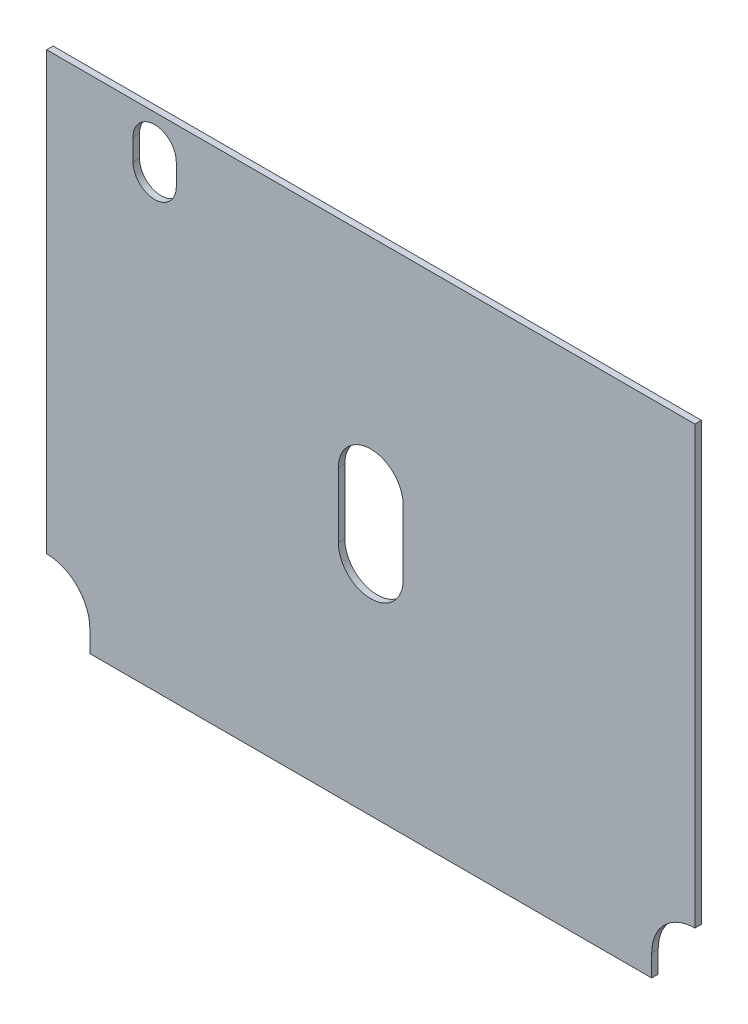
ISO-10303-21;
HEADER;
FILE_DESCRIPTION(('STEP AP214'),'2;1');
FILE_NAME('part.step','',(''),(''),'','','');
FILE_SCHEMA(('AUTOMOTIVE_DESIGN { 1 0 10303 214 1 1 1 1 }'));
ENDSEC;
DATA;
#1=APPLICATION_CONTEXT('core data for automotive mechanical design processes');
#2=APPLICATION_PROTOCOL_DEFINITION('international standard','automotive_design',2000,#1);
#3=PRODUCT_CONTEXT('',#1,'mechanical');
#4=PRODUCT('Part','Part','',(#3));
#5=PRODUCT_RELATED_PRODUCT_CATEGORY('part','',(#4));
#6=PRODUCT_DEFINITION_FORMATION('','',#4);
#7=PRODUCT_DEFINITION_CONTEXT('part definition',#1,'design');
#8=PRODUCT_DEFINITION('design','',#6,#7);
#9=PRODUCT_DEFINITION_SHAPE('','',#8);
#10=(LENGTH_UNIT() NAMED_UNIT(*) SI_UNIT(.MILLI.,.METRE.));
#11=(NAMED_UNIT(*) PLANE_ANGLE_UNIT() SI_UNIT($,.RADIAN.));
#12=(NAMED_UNIT(*) SI_UNIT($,.STERADIAN.) SOLID_ANGLE_UNIT());
#13=UNCERTAINTY_MEASURE_WITH_UNIT(LENGTH_MEASURE(1.E-05),#10,'distance_accuracy_value','');
#14=(GEOMETRIC_REPRESENTATION_CONTEXT(3) GLOBAL_UNCERTAINTY_ASSIGNED_CONTEXT((#13)) GLOBAL_UNIT_ASSIGNED_CONTEXT((#10,
#11,#12)) REPRESENTATION_CONTEXT('',''));
#15=CARTESIAN_POINT('',(0.,0.,0.));
#16=DIRECTION('',(0.,0.,1.));
#17=DIRECTION('',(1.,0.,0.));
#18=AXIS2_PLACEMENT_3D('',#15,#16,#17);
#19=CARTESIAN_POINT('',(-150.,9.99999999999999,3.));
#20=DIRECTION('',(0.,0.,-1.));
#21=DIRECTION('',(-1.,0.,0.));
#22=AXIS2_PLACEMENT_3D('',#19,#20,#21);
#23=PLANE('',#22);
#24=CARTESIAN_POINT('',(0.,102.,3.));
#25=DIRECTION('',(0.,0.,1.));
#26=DIRECTION('',(1.,0.,0.));
#27=AXIS2_PLACEMENT_3D('',#24,#25,#26);
#28=CIRCLE('',#27,15.);
#29=CARTESIAN_POINT('',(-15.,102.,3.));
#30=VERTEX_POINT('',#29);
#31=CARTESIAN_POINT('',(15.,102.,3.));
#32=VERTEX_POINT('',#31);
#33=EDGE_CURVE('E180',#30,#32,#28,.T.);
#34=ORIENTED_EDGE('',*,*,#33,.F.);
#35=DIRECTION('',(0.,-1.,0.));
#36=VECTOR('',#35,1.);
#37=CARTESIAN_POINT('',(-15.,102.,3.));
#38=LINE('',#37,#36);
#39=CARTESIAN_POINT('',(-15.,132.,3.));
#40=VERTEX_POINT('',#39);
#41=EDGE_CURVE('E188',#40,#30,#38,.T.);
#42=ORIENTED_EDGE('',*,*,#41,.F.);
#43=CARTESIAN_POINT('',(0.,132.,3.));
#44=DIRECTION('',(0.,0.,1.));
#45=DIRECTION('',(-1.,0.,0.));
#46=AXIS2_PLACEMENT_3D('',#43,#44,#45);
#47=CIRCLE('',#46,15.);
#48=CARTESIAN_POINT('',(15.,132.,3.));
#49=VERTEX_POINT('',#48);
#50=EDGE_CURVE('E185',#49,#40,#47,.T.);
#51=ORIENTED_EDGE('',*,*,#50,.F.);
#52=DIRECTION('',(0.,1.,0.));
#53=VECTOR('',#52,1.);
#54=CARTESIAN_POINT('',(15.,132.,3.));
#55=LINE('',#54,#53);
#56=EDGE_CURVE('E182',#32,#49,#55,.T.);
#57=ORIENTED_EDGE('',*,*,#56,.F.);
#58=EDGE_LOOP('',(#34,#42,#51,#57));
#59=FACE_BOUND('',#58,.T.);
#60=DIRECTION('',(0.,-1.,0.));
#61=VECTOR('',#60,1.);
#62=CARTESIAN_POINT('',(-150.,232.,3.));
#63=LINE('',#62,#61);
#64=CARTESIAN_POINT('',(-150.,232.,3.));
#65=VERTEX_POINT('',#64);
#66=CARTESIAN_POINT('',(-150.,30.,3.));
#67=VERTEX_POINT('',#66);
#68=EDGE_CURVE('E211',#65,#67,#63,.T.);
#69=ORIENTED_EDGE('',*,*,#68,.T.);
#70=CARTESIAN_POINT('',(-150.,9.99999999999999,3.));
#71=DIRECTION('',(0.,0.,-1.));
#72=DIRECTION('',(-1.,0.,0.));
#73=AXIS2_PLACEMENT_3D('',#70,#71,#72);
#74=CIRCLE('',#73,20.);
#75=CARTESIAN_POINT('',(-130.,9.99999999999999,3.));
#76=VERTEX_POINT('',#75);
#77=EDGE_CURVE('E214',#67,#76,#74,.T.);
#78=ORIENTED_EDGE('',*,*,#77,.T.);
#79=DIRECTION('',(0.,-1.,0.));
#80=VECTOR('',#79,1.);
#81=CARTESIAN_POINT('',(-130.,0.,3.));
#82=LINE('',#81,#80);
#83=CARTESIAN_POINT('',(-130.,0.,3.));
#84=VERTEX_POINT('',#83);
#85=EDGE_CURVE('E217',#76,#84,#82,.T.);
#86=ORIENTED_EDGE('',*,*,#85,.T.);
#87=DIRECTION('',(1.,0.,0.));
#88=VECTOR('',#87,1.);
#89=CARTESIAN_POINT('',(130.,0.,3.));
#90=LINE('',#89,#88);
#91=CARTESIAN_POINT('',(130.,0.,3.));
#92=VERTEX_POINT('',#91);
#93=EDGE_CURVE('E219',#84,#92,#90,.T.);
#94=ORIENTED_EDGE('',*,*,#93,.T.);
#95=DIRECTION('',(0.,1.,0.));
#96=VECTOR('',#95,1.);
#97=CARTESIAN_POINT('',(130.,0.,3.));
#98=LINE('',#97,#96);
#99=CARTESIAN_POINT('',(130.,9.99999999999999,3.));
#100=VERTEX_POINT('',#99);
#101=EDGE_CURVE('E221',#92,#100,#98,.T.);
#102=ORIENTED_EDGE('',*,*,#101,.T.);
#103=CARTESIAN_POINT('',(150.,9.99999999999998,3.));
#104=DIRECTION('',(0.,0.,-1.));
#105=DIRECTION('',(1.,0.,0.));
#106=AXIS2_PLACEMENT_3D('',#103,#104,#105);
#107=CIRCLE('',#106,20.);
#108=CARTESIAN_POINT('',(150.,30.,3.));
#109=VERTEX_POINT('',#108);
#110=EDGE_CURVE('E223',#100,#109,#107,.T.);
#111=ORIENTED_EDGE('',*,*,#110,.T.);
#112=DIRECTION('',(0.,1.,0.));
#113=VECTOR('',#112,1.);
#114=CARTESIAN_POINT('',(150.,232.,3.));
#115=LINE('',#114,#113);
#116=CARTESIAN_POINT('',(150.,232.,3.));
#117=VERTEX_POINT('',#116);
#118=EDGE_CURVE('E225',#109,#117,#115,.T.);
#119=ORIENTED_EDGE('',*,*,#118,.T.);
#120=DIRECTION('',(-1.,0.,0.));
#121=VECTOR('',#120,1.);
#122=CARTESIAN_POINT('',(150.,232.,3.));
#123=LINE('',#122,#121);
#124=EDGE_CURVE('E227',#117,#65,#123,.T.);
#125=ORIENTED_EDGE('',*,*,#124,.T.);
#126=EDGE_LOOP('',(#69,#78,#86,#94,#102,#111,#119,#125));
#127=FACE_BOUND('',#126,.T.);
#128=CARTESIAN_POINT('',(-100.,207.,3.));
#129=DIRECTION('',(0.,0.,1.));
#130=DIRECTION('',(1.,0.,0.));
#131=AXIS2_PLACEMENT_3D('',#128,#129,#130);
#132=CIRCLE('',#131,10.);
#133=CARTESIAN_POINT('',(-110.,207.,3.));
#134=VERTEX_POINT('',#133);
#135=CARTESIAN_POINT('',(-90.,207.,3.));
#136=VERTEX_POINT('',#135);
#137=EDGE_CURVE('E144',#134,#136,#132,.T.);
#138=ORIENTED_EDGE('',*,*,#137,.F.);
#139=DIRECTION('',(0.,-1.,0.));
#140=VECTOR('',#139,1.);
#141=CARTESIAN_POINT('',(-110.,207.,3.));
#142=LINE('',#141,#140);
#143=CARTESIAN_POINT('',(-110.,217.,3.));
#144=VERTEX_POINT('',#143);
#145=EDGE_CURVE('E166',#144,#134,#142,.T.);
#146=ORIENTED_EDGE('',*,*,#145,.F.);
#147=CARTESIAN_POINT('',(-100.,217.,3.));
#148=DIRECTION('',(0.,0.,1.));
#149=DIRECTION('',(-1.,0.,0.));
#150=AXIS2_PLACEMENT_3D('',#147,#148,#149);
#151=CIRCLE('',#150,10.);
#152=CARTESIAN_POINT('',(-90.,217.,3.));
#153=VERTEX_POINT('',#152);
#154=EDGE_CURVE('E164',#153,#144,#151,.T.);
#155=ORIENTED_EDGE('',*,*,#154,.F.);
#156=DIRECTION('',(0.,1.,0.));
#157=VECTOR('',#156,1.);
#158=CARTESIAN_POINT('',(-90.,217.,3.));
#159=LINE('',#158,#157);
#160=EDGE_CURVE('E152',#136,#153,#159,.T.);
#161=ORIENTED_EDGE('',*,*,#160,.F.);
#162=EDGE_LOOP('',(#138,#146,#155,#161));
#163=FACE_BOUND('',#162,.T.);
#164=ADVANCED_FACE('F31',(#59,#127,#163),#23,.F.);
#165=CARTESIAN_POINT('',(-150.,9.99999999999999,0.));
#166=DIRECTION('',(0.,0.,-1.));
#167=DIRECTION('',(-1.,0.,0.));
#168=AXIS2_PLACEMENT_3D('',#165,#166,#167);
#169=PLANE('',#168);
#170=DIRECTION('',(0.,-1.,0.));
#171=VECTOR('',#170,1.);
#172=CARTESIAN_POINT('',(-15.,102.,0.));
#173=LINE('',#172,#171);
#174=CARTESIAN_POINT('',(-15.,132.,0.));
#175=VERTEX_POINT('',#174);
#176=CARTESIAN_POINT('',(-15.,102.,0.));
#177=VERTEX_POINT('',#176);
#178=EDGE_CURVE('E183',#175,#177,#173,.T.);
#179=ORIENTED_EDGE('',*,*,#178,.T.);
#180=CARTESIAN_POINT('',(0.,102.,0.));
#181=DIRECTION('',(0.,0.,1.));
#182=DIRECTION('',(1.,0.,0.));
#183=AXIS2_PLACEMENT_3D('',#180,#181,#182);
#184=CIRCLE('',#183,15.);
#185=CARTESIAN_POINT('',(15.,102.,0.));
#186=VERTEX_POINT('',#185);
#187=EDGE_CURVE('E160',#177,#186,#184,.T.);
#188=ORIENTED_EDGE('',*,*,#187,.T.);
#189=DIRECTION('',(0.,1.,0.));
#190=VECTOR('',#189,1.);
#191=CARTESIAN_POINT('',(15.,132.,0.));
#192=LINE('',#191,#190);
#193=CARTESIAN_POINT('',(15.,132.,0.));
#194=VERTEX_POINT('',#193);
#195=EDGE_CURVE('E193',#186,#194,#192,.T.);
#196=ORIENTED_EDGE('',*,*,#195,.T.);
#197=CARTESIAN_POINT('',(0.,132.,0.));
#198=DIRECTION('',(0.,0.,1.));
#199=DIRECTION('',(-1.,0.,0.));
#200=AXIS2_PLACEMENT_3D('',#197,#198,#199);
#201=CIRCLE('',#200,15.);
#202=EDGE_CURVE('E196',#194,#175,#201,.T.);
#203=ORIENTED_EDGE('',*,*,#202,.T.);
#204=EDGE_LOOP('',(#179,#188,#196,#203));
#205=FACE_BOUND('',#204,.T.);
#206=DIRECTION('',(0.,-1.,0.));
#207=VECTOR('',#206,1.);
#208=CARTESIAN_POINT('',(-150.,232.,0.));
#209=LINE('',#208,#207);
#210=CARTESIAN_POINT('',(-150.,232.,0.));
#211=VERTEX_POINT('',#210);
#212=CARTESIAN_POINT('',(-150.,30.,0.));
#213=VERTEX_POINT('',#212);
#214=EDGE_CURVE('E210',#211,#213,#209,.T.);
#215=ORIENTED_EDGE('',*,*,#214,.F.);
#216=DIRECTION('',(-1.,0.,0.));
#217=VECTOR('',#216,1.);
#218=CARTESIAN_POINT('',(150.,232.,0.));
#219=LINE('',#218,#217);
#220=CARTESIAN_POINT('',(150.,232.,0.));
#221=VERTEX_POINT('',#220);
#222=EDGE_CURVE('E215',#221,#211,#219,.T.);
#223=ORIENTED_EDGE('',*,*,#222,.F.);
#224=DIRECTION('',(0.,1.,0.));
#225=VECTOR('',#224,1.);
#226=CARTESIAN_POINT('',(150.,232.,0.));
#227=LINE('',#226,#225);
#228=CARTESIAN_POINT('',(150.,30.,0.));
#229=VERTEX_POINT('',#228);
#230=EDGE_CURVE('E242',#229,#221,#227,.T.);
#231=ORIENTED_EDGE('',*,*,#230,.F.);
#232=CARTESIAN_POINT('',(150.,9.99999999999998,0.));
#233=DIRECTION('',(0.,0.,-1.));
#234=DIRECTION('',(1.,0.,0.));
#235=AXIS2_PLACEMENT_3D('',#232,#233,#234);
#236=CIRCLE('',#235,20.);
#237=CARTESIAN_POINT('',(130.,9.99999999999999,0.));
#238=VERTEX_POINT('',#237);
#239=EDGE_CURVE('E240',#238,#229,#236,.T.);
#240=ORIENTED_EDGE('',*,*,#239,.F.);
#241=DIRECTION('',(0.,1.,0.));
#242=VECTOR('',#241,1.);
#243=CARTESIAN_POINT('',(130.,0.,0.));
#244=LINE('',#243,#242);
#245=CARTESIAN_POINT('',(130.,0.,0.));
#246=VERTEX_POINT('',#245);
#247=EDGE_CURVE('E238',#246,#238,#244,.T.);
#248=ORIENTED_EDGE('',*,*,#247,.F.);
#249=DIRECTION('',(1.,0.,0.));
#250=VECTOR('',#249,1.);
#251=CARTESIAN_POINT('',(130.,0.,0.));
#252=LINE('',#251,#250);
#253=CARTESIAN_POINT('',(-130.,0.,0.));
#254=VERTEX_POINT('',#253);
#255=EDGE_CURVE('E236',#254,#246,#252,.T.);
#256=ORIENTED_EDGE('',*,*,#255,.F.);
#257=DIRECTION('',(0.,-1.,0.));
#258=VECTOR('',#257,1.);
#259=CARTESIAN_POINT('',(-130.,0.,0.));
#260=LINE('',#259,#258);
#261=CARTESIAN_POINT('',(-130.,9.99999999999999,0.));
#262=VERTEX_POINT('',#261);
#263=EDGE_CURVE('E234',#262,#254,#260,.T.);
#264=ORIENTED_EDGE('',*,*,#263,.F.);
#265=CARTESIAN_POINT('',(-150.,9.99999999999999,0.));
#266=DIRECTION('',(0.,0.,-1.));
#267=DIRECTION('',(-1.,0.,0.));
#268=AXIS2_PLACEMENT_3D('',#265,#266,#267);
#269=CIRCLE('',#268,20.);
#270=EDGE_CURVE('E232',#213,#262,#269,.T.);
#271=ORIENTED_EDGE('',*,*,#270,.F.);
#272=EDGE_LOOP('',(#215,#223,#231,#240,#248,#256,#264,#271));
#273=FACE_BOUND('',#272,.T.);
#274=DIRECTION('',(0.,-1.,0.));
#275=VECTOR('',#274,1.);
#276=CARTESIAN_POINT('',(-110.,207.,0.));
#277=LINE('',#276,#275);
#278=CARTESIAN_POINT('',(-110.,217.,0.));
#279=VERTEX_POINT('',#278);
#280=CARTESIAN_POINT('',(-110.,207.,0.));
#281=VERTEX_POINT('',#280);
#282=EDGE_CURVE('E153',#279,#281,#277,.T.);
#283=ORIENTED_EDGE('',*,*,#282,.T.);
#284=CARTESIAN_POINT('',(-100.,207.,0.));
#285=DIRECTION('',(0.,0.,1.));
#286=DIRECTION('',(1.,0.,0.));
#287=AXIS2_PLACEMENT_3D('',#284,#285,#286);
#288=CIRCLE('',#287,10.);
#289=CARTESIAN_POINT('',(-90.,207.,0.));
#290=VERTEX_POINT('',#289);
#291=EDGE_CURVE('E54',#281,#290,#288,.T.);
#292=ORIENTED_EDGE('',*,*,#291,.T.);
#293=DIRECTION('',(0.,1.,0.));
#294=VECTOR('',#293,1.);
#295=CARTESIAN_POINT('',(-90.,217.,0.));
#296=LINE('',#295,#294);
#297=CARTESIAN_POINT('',(-90.,217.,0.));
#298=VERTEX_POINT('',#297);
#299=EDGE_CURVE('E159',#290,#298,#296,.T.);
#300=ORIENTED_EDGE('',*,*,#299,.T.);
#301=CARTESIAN_POINT('',(-100.,217.,0.));
#302=DIRECTION('',(0.,0.,1.));
#303=DIRECTION('',(-1.,0.,0.));
#304=AXIS2_PLACEMENT_3D('',#301,#302,#303);
#305=CIRCLE('',#304,10.);
#306=EDGE_CURVE('E172',#298,#279,#305,.T.);
#307=ORIENTED_EDGE('',*,*,#306,.T.);
#308=EDGE_LOOP('',(#283,#292,#300,#307));
#309=FACE_BOUND('',#308,.T.);
#310=ADVANCED_FACE('F272',(#205,#273,#309),#169,.T.);
#311=CARTESIAN_POINT('',(-150.,232.,3.));
#312=DIRECTION('',(1.,0.,0.));
#313=DIRECTION('',(0.,1.,0.));
#314=AXIS2_PLACEMENT_3D('',#311,#312,#313);
#315=PLANE('',#314);
#316=ORIENTED_EDGE('',*,*,#214,.T.);
#317=DIRECTION('',(0.,0.,-1.));
#318=VECTOR('',#317,1.);
#319=CARTESIAN_POINT('',(-150.,30.,3.));
#320=LINE('',#319,#318);
#321=EDGE_CURVE('E11',#67,#213,#320,.T.);
#322=ORIENTED_EDGE('',*,*,#321,.F.);
#323=ORIENTED_EDGE('',*,*,#68,.F.);
#324=DIRECTION('',(0.,0.,-1.));
#325=VECTOR('',#324,1.);
#326=CARTESIAN_POINT('',(-150.,232.,3.));
#327=LINE('',#326,#325);
#328=EDGE_CURVE('E229',#65,#211,#327,.T.);
#329=ORIENTED_EDGE('',*,*,#328,.T.);
#330=EDGE_LOOP('',(#316,#322,#323,#329));
#331=FACE_BOUND('',#330,.T.);
#332=ADVANCED_FACE('F33',(#331),#315,.F.);
#333=CARTESIAN_POINT('',(-150.,9.99999999999999,3.));
#334=DIRECTION('',(0.,0.,-1.));
#335=DIRECTION('',(-1.,0.,0.));
#336=AXIS2_PLACEMENT_3D('',#333,#334,#335);
#337=CYLINDRICAL_SURFACE('',#336,20.);
#338=ORIENTED_EDGE('',*,*,#270,.T.);
#339=DIRECTION('',(0.,0.,-1.));
#340=VECTOR('',#339,1.);
#341=CARTESIAN_POINT('',(-130.,9.99999999999999,3.));
#342=LINE('',#341,#340);
#343=EDGE_CURVE('E39',#76,#262,#342,.T.);
#344=ORIENTED_EDGE('',*,*,#343,.F.);
#345=ORIENTED_EDGE('',*,*,#77,.F.);
#346=ORIENTED_EDGE('',*,*,#321,.T.);
#347=EDGE_LOOP('',(#338,#344,#345,#346));
#348=FACE_BOUND('',#347,.T.);
#349=ADVANCED_FACE('F289',(#348),#337,.F.);
#350=CARTESIAN_POINT('',(-130.,0.,3.));
#351=DIRECTION('',(1.,0.,0.));
#352=DIRECTION('',(0.,0.,-1.));
#353=AXIS2_PLACEMENT_3D('',#350,#351,#352);
#354=PLANE('',#353);
#355=ORIENTED_EDGE('',*,*,#263,.T.);
#356=DIRECTION('',(0.,0.,-1.));
#357=VECTOR('',#356,1.);
#358=CARTESIAN_POINT('',(-130.,0.,3.));
#359=LINE('',#358,#357);
#360=EDGE_CURVE('E259',#84,#254,#359,.T.);
#361=ORIENTED_EDGE('',*,*,#360,.F.);
#362=ORIENTED_EDGE('',*,*,#85,.F.);
#363=ORIENTED_EDGE('',*,*,#343,.T.);
#364=EDGE_LOOP('',(#355,#361,#362,#363));
#365=FACE_BOUND('',#364,.T.);
#366=ADVANCED_FACE('F266',(#365),#354,.F.);
#367=CARTESIAN_POINT('',(130.,0.,3.));
#368=DIRECTION('',(0.,1.,0.));
#369=DIRECTION('',(-1.,0.,0.));
#370=AXIS2_PLACEMENT_3D('',#367,#368,#369);
#371=PLANE('',#370);
#372=ORIENTED_EDGE('',*,*,#255,.T.);
#373=DIRECTION('',(0.,0.,-1.));
#374=VECTOR('',#373,1.);
#375=CARTESIAN_POINT('',(130.,0.,3.));
#376=LINE('',#375,#374);
#377=EDGE_CURVE('E256',#92,#246,#376,.T.);
#378=ORIENTED_EDGE('',*,*,#377,.F.);
#379=ORIENTED_EDGE('',*,*,#93,.F.);
#380=ORIENTED_EDGE('',*,*,#360,.T.);
#381=EDGE_LOOP('',(#372,#378,#379,#380));
#382=FACE_BOUND('',#381,.T.);
#383=ADVANCED_FACE('F278',(#382),#371,.F.);
#384=CARTESIAN_POINT('',(130.,0.,3.));
#385=DIRECTION('',(-1.,0.,0.));
#386=DIRECTION('',(0.,0.,1.));
#387=AXIS2_PLACEMENT_3D('',#384,#385,#386);
#388=PLANE('',#387);
#389=ORIENTED_EDGE('',*,*,#247,.T.);
#390=DIRECTION('',(0.,0.,-1.));
#391=VECTOR('',#390,1.);
#392=CARTESIAN_POINT('',(130.,9.99999999999999,3.));
#393=LINE('',#392,#391);
#394=EDGE_CURVE('E253',#100,#238,#393,.T.);
#395=ORIENTED_EDGE('',*,*,#394,.F.);
#396=ORIENTED_EDGE('',*,*,#101,.F.);
#397=ORIENTED_EDGE('',*,*,#377,.T.);
#398=EDGE_LOOP('',(#389,#395,#396,#397));
#399=FACE_BOUND('',#398,.T.);
#400=ADVANCED_FACE('F282',(#399),#388,.F.);
#401=CARTESIAN_POINT('',(150.,9.99999999999998,3.));
#402=DIRECTION('',(0.,0.,-1.));
#403=DIRECTION('',(-1.,0.,0.));
#404=AXIS2_PLACEMENT_3D('',#401,#402,#403);
#405=CYLINDRICAL_SURFACE('',#404,20.);
#406=ORIENTED_EDGE('',*,*,#239,.T.);
#407=DIRECTION('',(0.,0.,-1.));
#408=VECTOR('',#407,1.);
#409=CARTESIAN_POINT('',(150.,30.,3.));
#410=LINE('',#409,#408);
#411=EDGE_CURVE('E250',#109,#229,#410,.T.);
#412=ORIENTED_EDGE('',*,*,#411,.F.);
#413=ORIENTED_EDGE('',*,*,#110,.F.);
#414=ORIENTED_EDGE('',*,*,#394,.T.);
#415=EDGE_LOOP('',(#406,#412,#413,#414));
#416=FACE_BOUND('',#415,.T.);
#417=ADVANCED_FACE('F302',(#416),#405,.F.);
#418=CARTESIAN_POINT('',(150.,232.,3.));
#419=DIRECTION('',(-1.,0.,0.));
#420=DIRECTION('',(0.,-1.,0.));
#421=AXIS2_PLACEMENT_3D('',#418,#419,#420);
#422=PLANE('',#421);
#423=ORIENTED_EDGE('',*,*,#230,.T.);
#424=DIRECTION('',(0.,0.,-1.));
#425=VECTOR('',#424,1.);
#426=CARTESIAN_POINT('',(150.,232.,3.));
#427=LINE('',#426,#425);
#428=EDGE_CURVE('E247',#117,#221,#427,.T.);
#429=ORIENTED_EDGE('',*,*,#428,.F.);
#430=ORIENTED_EDGE('',*,*,#118,.F.);
#431=ORIENTED_EDGE('',*,*,#411,.T.);
#432=EDGE_LOOP('',(#423,#429,#430,#431));
#433=FACE_BOUND('',#432,.T.);
#434=ADVANCED_FACE('F300',(#433),#422,.F.);
#435=CARTESIAN_POINT('',(150.,232.,3.));
#436=DIRECTION('',(0.,-1.,0.));
#437=DIRECTION('',(1.,0.,0.));
#438=AXIS2_PLACEMENT_3D('',#435,#436,#437);
#439=PLANE('',#438);
#440=ORIENTED_EDGE('',*,*,#222,.T.);
#441=ORIENTED_EDGE('',*,*,#328,.F.);
#442=ORIENTED_EDGE('',*,*,#124,.F.);
#443=ORIENTED_EDGE('',*,*,#428,.T.);
#444=EDGE_LOOP('',(#440,#441,#442,#443));
#445=FACE_BOUND('',#444,.T.);
#446=ADVANCED_FACE('F295',(#445),#439,.F.);
#447=CARTESIAN_POINT('',(0.,102.,3.));
#448=DIRECTION('',(0.,0.,-1.));
#449=DIRECTION('',(-1.,0.,0.));
#450=AXIS2_PLACEMENT_3D('',#447,#448,#449);
#451=CYLINDRICAL_SURFACE('',#450,15.);
#452=ORIENTED_EDGE('',*,*,#187,.F.);
#453=DIRECTION('',(0.,0.,-1.));
#454=VECTOR('',#453,1.);
#455=CARTESIAN_POINT('',(-15.,102.,3.));
#456=LINE('',#455,#454);
#457=EDGE_CURVE('E190',#30,#177,#456,.T.);
#458=ORIENTED_EDGE('',*,*,#457,.F.);
#459=ORIENTED_EDGE('',*,*,#33,.T.);
#460=DIRECTION('',(0.,0.,-1.));
#461=VECTOR('',#460,1.);
#462=CARTESIAN_POINT('',(15.,102.,3.));
#463=LINE('',#462,#461);
#464=EDGE_CURVE('E207',#32,#186,#463,.T.);
#465=ORIENTED_EDGE('',*,*,#464,.T.);
#466=EDGE_LOOP('',(#452,#458,#459,#465));
#467=FACE_BOUND('',#466,.T.);
#468=ADVANCED_FACE('F321',(#467),#451,.F.);
#469=CARTESIAN_POINT('',(15.,132.,3.));
#470=DIRECTION('',(-1.,0.,0.));
#471=DIRECTION('',(0.,0.,1.));
#472=AXIS2_PLACEMENT_3D('',#469,#470,#471);
#473=PLANE('',#472);
#474=ORIENTED_EDGE('',*,*,#195,.F.);
#475=ORIENTED_EDGE('',*,*,#464,.F.);
#476=ORIENTED_EDGE('',*,*,#56,.T.);
#477=DIRECTION('',(0.,0.,-1.));
#478=VECTOR('',#477,1.);
#479=CARTESIAN_POINT('',(15.,132.,3.));
#480=LINE('',#479,#478);
#481=EDGE_CURVE('E205',#49,#194,#480,.T.);
#482=ORIENTED_EDGE('',*,*,#481,.T.);
#483=EDGE_LOOP('',(#474,#475,#476,#482));
#484=FACE_BOUND('',#483,.T.);
#485=ADVANCED_FACE('F328',(#484),#473,.T.);
#486=CARTESIAN_POINT('',(0.,132.,3.));
#487=DIRECTION('',(0.,0.,-1.));
#488=DIRECTION('',(-1.,0.,0.));
#489=AXIS2_PLACEMENT_3D('',#486,#487,#488);
#490=CYLINDRICAL_SURFACE('',#489,15.);
#491=ORIENTED_EDGE('',*,*,#202,.F.);
#492=ORIENTED_EDGE('',*,*,#481,.F.);
#493=ORIENTED_EDGE('',*,*,#50,.T.);
#494=DIRECTION('',(0.,0.,-1.));
#495=VECTOR('',#494,1.);
#496=CARTESIAN_POINT('',(-15.,132.,3.));
#497=LINE('',#496,#495);
#498=EDGE_CURVE('E203',#40,#175,#497,.T.);
#499=ORIENTED_EDGE('',*,*,#498,.T.);
#500=EDGE_LOOP('',(#491,#492,#493,#499));
#501=FACE_BOUND('',#500,.T.);
#502=ADVANCED_FACE('F333',(#501),#490,.F.);
#503=CARTESIAN_POINT('',(-15.,102.,3.));
#504=DIRECTION('',(1.,0.,0.));
#505=DIRECTION('',(0.,0.,-1.));
#506=AXIS2_PLACEMENT_3D('',#503,#504,#505);
#507=PLANE('',#506);
#508=ORIENTED_EDGE('',*,*,#178,.F.);
#509=ORIENTED_EDGE('',*,*,#498,.F.);
#510=ORIENTED_EDGE('',*,*,#41,.T.);
#511=ORIENTED_EDGE('',*,*,#457,.T.);
#512=EDGE_LOOP('',(#508,#509,#510,#511));
#513=FACE_BOUND('',#512,.T.);
#514=ADVANCED_FACE('F339',(#513),#507,.T.);
#515=CARTESIAN_POINT('',(-100.,207.,3.));
#516=DIRECTION('',(0.,0.,-1.));
#517=DIRECTION('',(-1.,0.,0.));
#518=AXIS2_PLACEMENT_3D('',#515,#516,#517);
#519=CYLINDRICAL_SURFACE('',#518,10.);
#520=ORIENTED_EDGE('',*,*,#291,.F.);
#521=DIRECTION('',(0.,0.,-1.));
#522=VECTOR('',#521,1.);
#523=CARTESIAN_POINT('',(-110.,207.,3.));
#524=LINE('',#523,#522);
#525=EDGE_CURVE('E148',#134,#281,#524,.T.);
#526=ORIENTED_EDGE('',*,*,#525,.F.);
#527=ORIENTED_EDGE('',*,*,#137,.T.);
#528=DIRECTION('',(0.,0.,-1.));
#529=VECTOR('',#528,1.);
#530=CARTESIAN_POINT('',(-90.,207.,3.));
#531=LINE('',#530,#529);
#532=EDGE_CURVE('E147',#136,#290,#531,.T.);
#533=ORIENTED_EDGE('',*,*,#532,.T.);
#534=EDGE_LOOP('',(#520,#526,#527,#533));
#535=FACE_BOUND('',#534,.T.);
#536=ADVANCED_FACE('F146',(#535),#519,.F.);
#537=CARTESIAN_POINT('',(-90.,217.,3.));
#538=DIRECTION('',(-1.,0.,0.));
#539=DIRECTION('',(0.,0.,1.));
#540=AXIS2_PLACEMENT_3D('',#537,#538,#539);
#541=PLANE('',#540);
#542=ORIENTED_EDGE('',*,*,#299,.F.);
#543=ORIENTED_EDGE('',*,*,#532,.F.);
#544=ORIENTED_EDGE('',*,*,#160,.T.);
#545=DIRECTION('',(0.,0.,-1.));
#546=VECTOR('',#545,1.);
#547=CARTESIAN_POINT('',(-90.,217.,3.));
#548=LINE('',#547,#546);
#549=EDGE_CURVE('E161',#153,#298,#548,.T.);
#550=ORIENTED_EDGE('',*,*,#549,.T.);
#551=EDGE_LOOP('',(#542,#543,#544,#550));
#552=FACE_BOUND('',#551,.T.);
#553=ADVANCED_FACE('F156',(#552),#541,.T.);
#554=CARTESIAN_POINT('',(-100.,217.,3.));
#555=DIRECTION('',(0.,0.,-1.));
#556=DIRECTION('',(-1.,0.,0.));
#557=AXIS2_PLACEMENT_3D('',#554,#555,#556);
#558=CYLINDRICAL_SURFACE('',#557,10.);
#559=ORIENTED_EDGE('',*,*,#306,.F.);
#560=ORIENTED_EDGE('',*,*,#549,.F.);
#561=ORIENTED_EDGE('',*,*,#154,.T.);
#562=DIRECTION('',(0.,0.,-1.));
#563=VECTOR('',#562,1.);
#564=CARTESIAN_POINT('',(-110.,217.,3.));
#565=LINE('',#564,#563);
#566=EDGE_CURVE('E46',#144,#279,#565,.T.);
#567=ORIENTED_EDGE('',*,*,#566,.T.);
#568=EDGE_LOOP('',(#559,#560,#561,#567));
#569=FACE_BOUND('',#568,.T.);
#570=ADVANCED_FACE('F357',(#569),#558,.F.);
#571=CARTESIAN_POINT('',(-110.,207.,3.));
#572=DIRECTION('',(1.,0.,0.));
#573=DIRECTION('',(0.,1.,0.));
#574=AXIS2_PLACEMENT_3D('',#571,#572,#573);
#575=PLANE('',#574);
#576=ORIENTED_EDGE('',*,*,#282,.F.);
#577=ORIENTED_EDGE('',*,*,#566,.F.);
#578=ORIENTED_EDGE('',*,*,#145,.T.);
#579=ORIENTED_EDGE('',*,*,#525,.T.);
#580=EDGE_LOOP('',(#576,#577,#578,#579));
#581=FACE_BOUND('',#580,.T.);
#582=ADVANCED_FACE('F360',(#581),#575,.T.);
#583=CLOSED_SHELL('',(#164,#310,#332,#349,#366,#383,#400,#417,#434,#446,#468,#485,#502,#514,
#536,#553,#570,#582));
#584=MANIFOLD_SOLID_BREP('B2',#583);
#585=ADVANCED_BREP_SHAPE_REPRESENTATION('',(#18,#584),#14);
#586=SHAPE_DEFINITION_REPRESENTATION(#9,#585);
ENDSEC;
END-ISO-10303-21;
